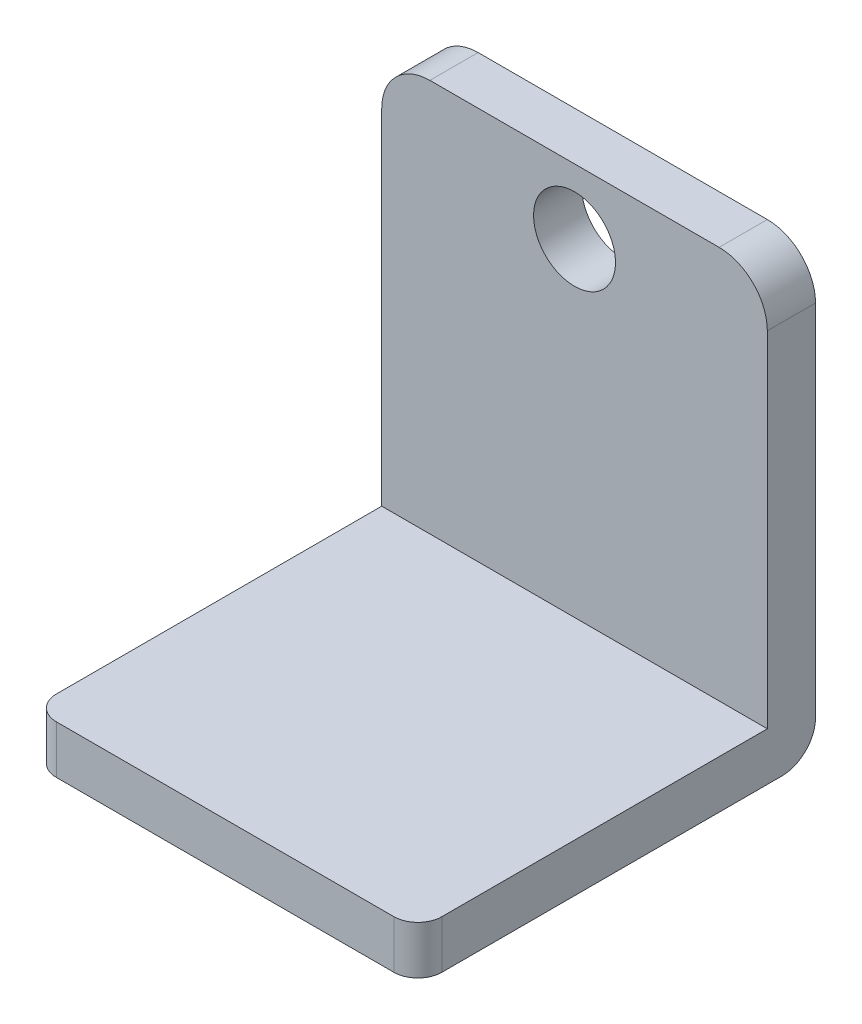
ISO-10303-21;
HEADER;
FILE_DESCRIPTION(('STEP AP214'),'2;1');
FILE_NAME('part.step','',(''),(''),'','','');
FILE_SCHEMA(('AUTOMOTIVE_DESIGN { 1 0 10303 214 1 1 1 1 }'));
ENDSEC;
DATA;
#1=APPLICATION_CONTEXT('core data for automotive mechanical design processes');
#2=APPLICATION_PROTOCOL_DEFINITION('international standard','automotive_design',2000,#1);
#3=PRODUCT_CONTEXT('',#1,'mechanical');
#4=PRODUCT('Part','Part','',(#3));
#5=PRODUCT_RELATED_PRODUCT_CATEGORY('part','',(#4));
#6=PRODUCT_DEFINITION_FORMATION('','',#4);
#7=PRODUCT_DEFINITION_CONTEXT('part definition',#1,'design');
#8=PRODUCT_DEFINITION('design','',#6,#7);
#9=PRODUCT_DEFINITION_SHAPE('','',#8);
#10=(LENGTH_UNIT() NAMED_UNIT(*) SI_UNIT(.MILLI.,.METRE.));
#11=(NAMED_UNIT(*) PLANE_ANGLE_UNIT() SI_UNIT($,.RADIAN.));
#12=(NAMED_UNIT(*) SI_UNIT($,.STERADIAN.) SOLID_ANGLE_UNIT());
#13=UNCERTAINTY_MEASURE_WITH_UNIT(LENGTH_MEASURE(1.E-05),#10,'distance_accuracy_value','');
#14=(GEOMETRIC_REPRESENTATION_CONTEXT(3) GLOBAL_UNCERTAINTY_ASSIGNED_CONTEXT((#13)) GLOBAL_UNIT_ASSIGNED_CONTEXT((#10,
#11,#12)) REPRESENTATION_CONTEXT('',''));
#15=CARTESIAN_POINT('',(0.,0.,0.));
#16=DIRECTION('',(0.,0.,1.));
#17=DIRECTION('',(1.,0.,0.));
#18=AXIS2_PLACEMENT_3D('',#15,#16,#17);
#19=CARTESIAN_POINT('',(-99.0809917355372,25.4,-108.317355371901));
#20=DIRECTION('',(1.,0.,0.));
#21=DIRECTION('',(0.,0.,-1.));
#22=AXIS2_PLACEMENT_3D('',#19,#20,#21);
#23=PLANE('',#22);
#24=DIRECTION('',(0.,0.,1.));
#25=VECTOR('',#24,1.);
#26=CARTESIAN_POINT('',(-99.0809917355372,0.,-108.317355371901));
#27=LINE('',#26,#25);
#28=CARTESIAN_POINT('',(-99.0809917355372,0.,-90.5373553719008));
#29=VERTEX_POINT('',#28);
#30=CARTESIAN_POINT('',(-99.0809917355372,0.,88.5326446280992));
#31=VERTEX_POINT('',#30);
#32=EDGE_CURVE('E154',#29,#31,#27,.T.);
#33=ORIENTED_EDGE('',*,*,#32,.T.);
#34=DIRECTION('',(0.,-1.,0.));
#35=VECTOR('',#34,1.);
#36=CARTESIAN_POINT('',(-99.0809917355372,25.4,88.5326446280992));
#37=LINE('',#36,#35);
#38=CARTESIAN_POINT('',(-99.0809917355372,25.4,88.5326446280992));
#39=VERTEX_POINT('',#38);
#40=EDGE_CURVE('E11',#31,#39,#37,.F.);
#41=ORIENTED_EDGE('',*,*,#40,.T.);
#42=DIRECTION('',(0.,0.,1.));
#43=VECTOR('',#42,1.);
#44=CARTESIAN_POINT('',(-99.0809917355372,25.4,-108.317355371901));
#45=LINE('',#44,#43);
#46=CARTESIAN_POINT('',(-99.0809917355372,25.4,-82.9173553719008));
#47=VERTEX_POINT('',#46);
#48=EDGE_CURVE('E155',#47,#39,#45,.T.);
#49=ORIENTED_EDGE('',*,*,#48,.F.);
#50=DIRECTION('',(0.,-1.,0.));
#51=VECTOR('',#50,1.);
#52=CARTESIAN_POINT('',(-99.0809917355372,232.41,-82.9173553719008));
#53=LINE('',#52,#51);
#54=CARTESIAN_POINT('',(-99.0809917355372,207.01,-82.9173553719008));
#55=VERTEX_POINT('',#54);
#56=EDGE_CURVE('E138',#55,#47,#53,.T.);
#57=ORIENTED_EDGE('',*,*,#56,.F.);
#58=DIRECTION('',(0.,0.,1.));
#59=VECTOR('',#58,1.);
#60=CARTESIAN_POINT('',(-99.0809917355372,207.01,-108.317355371901));
#61=LINE('',#60,#59);
#62=CARTESIAN_POINT('',(-99.0809917355372,207.01,-108.317355371901));
#63=VERTEX_POINT('',#62);
#64=EDGE_CURVE('E192',#55,#63,#61,.F.);
#65=ORIENTED_EDGE('',*,*,#64,.T.);
#66=DIRECTION('',(0.,-1.,0.));
#67=VECTOR('',#66,1.);
#68=CARTESIAN_POINT('',(-99.0809917355372,25.4,-108.317355371901));
#69=LINE('',#68,#67);
#70=CARTESIAN_POINT('',(-99.0809917355372,17.78,-108.317355371901));
#71=VERTEX_POINT('',#70);
#72=EDGE_CURVE('E127',#63,#71,#69,.T.);
#73=ORIENTED_EDGE('',*,*,#72,.T.);
#74=CARTESIAN_POINT('',(-99.0809917355372,17.78,-90.5373553719008));
#75=DIRECTION('',(1.,0.,0.));
#76=DIRECTION('',(0.,0.,-1.));
#77=AXIS2_PLACEMENT_3D('',#74,#75,#76);
#78=CIRCLE('',#77,17.78);
#79=EDGE_CURVE('E169',#71,#29,#78,.F.);
#80=ORIENTED_EDGE('',*,*,#79,.T.);
#81=EDGE_LOOP('',(#33,#41,#49,#57,#65,#73,#80));
#82=FACE_BOUND('',#81,.T.);
#83=ADVANCED_FACE('F33',(#82),#23,.F.);
#84=CARTESIAN_POINT('',(-99.0809917355372,25.4,101.232644628099));
#85=DIRECTION('',(0.,0.,-1.));
#86=DIRECTION('',(-1.,0.,0.));
#87=AXIS2_PLACEMENT_3D('',#84,#85,#86);
#88=PLANE('',#87);
#89=DIRECTION('',(1.,0.,0.));
#90=VECTOR('',#89,1.);
#91=CARTESIAN_POINT('',(-99.0809917355372,0.,101.232644628099));
#92=LINE('',#91,#90);
#93=CARTESIAN_POINT('',(-86.3809917355372,0.,101.232644628099));
#94=VERTEX_POINT('',#93);
#95=CARTESIAN_POINT('',(91.4190082644628,0.,101.232644628099));
#96=VERTEX_POINT('',#95);
#97=EDGE_CURVE('E160',#94,#96,#92,.T.);
#98=ORIENTED_EDGE('',*,*,#97,.T.);
#99=DIRECTION('',(0.,-1.,0.));
#100=VECTOR('',#99,1.);
#101=CARTESIAN_POINT('',(91.4190082644628,25.4,101.232644628099));
#102=LINE('',#101,#100);
#103=CARTESIAN_POINT('',(91.4190082644628,25.4,101.232644628099));
#104=VERTEX_POINT('',#103);
#105=EDGE_CURVE('E54',#96,#104,#102,.F.);
#106=ORIENTED_EDGE('',*,*,#105,.T.);
#107=DIRECTION('',(1.,0.,0.));
#108=VECTOR('',#107,1.);
#109=CARTESIAN_POINT('',(-99.0809917355372,25.4,101.232644628099));
#110=LINE('',#109,#108);
#111=CARTESIAN_POINT('',(-86.3809917355372,25.4,101.232644628099));
#112=VERTEX_POINT('',#111);
#113=EDGE_CURVE('E128',#112,#104,#110,.T.);
#114=ORIENTED_EDGE('',*,*,#113,.F.);
#115=DIRECTION('',(0.,-1.,0.));
#116=VECTOR('',#115,1.);
#117=CARTESIAN_POINT('',(-86.3809917355372,25.4,101.232644628099));
#118=LINE('',#117,#116);
#119=EDGE_CURVE('E200',#112,#94,#118,.T.);
#120=ORIENTED_EDGE('',*,*,#119,.T.);
#121=EDGE_LOOP('',(#98,#106,#114,#120));
#122=FACE_BOUND('',#121,.T.);
#123=ADVANCED_FACE('F208',(#122),#88,.F.);
#124=CARTESIAN_POINT('',(104.119008264463,25.4,-108.317355371901));
#125=DIRECTION('',(-1.,0.,0.));
#126=DIRECTION('',(0.,0.,1.));
#127=AXIS2_PLACEMENT_3D('',#124,#125,#126);
#128=PLANE('',#127);
#129=DIRECTION('',(0.,0.,-1.));
#130=VECTOR('',#129,1.);
#131=CARTESIAN_POINT('',(104.119008264463,25.4,-108.317355371901));
#132=LINE('',#131,#130);
#133=CARTESIAN_POINT('',(104.119008264463,25.4,88.5326446280992));
#134=VERTEX_POINT('',#133);
#135=CARTESIAN_POINT('',(104.119008264463,25.4,-82.9173553719008));
#136=VERTEX_POINT('',#135);
#137=EDGE_CURVE('E118',#134,#136,#132,.T.);
#138=ORIENTED_EDGE('',*,*,#137,.F.);
#139=DIRECTION('',(0.,-1.,0.));
#140=VECTOR('',#139,1.);
#141=CARTESIAN_POINT('',(104.119008264463,25.4,88.5326446280992));
#142=LINE('',#141,#140);
#143=CARTESIAN_POINT('',(104.119008264463,0.,88.5326446280992));
#144=VERTEX_POINT('',#143);
#145=EDGE_CURVE('E194',#134,#144,#142,.T.);
#146=ORIENTED_EDGE('',*,*,#145,.T.);
#147=DIRECTION('',(0.,0.,-1.));
#148=VECTOR('',#147,1.);
#149=CARTESIAN_POINT('',(104.119008264463,0.,-108.317355371901));
#150=LINE('',#149,#148);
#151=CARTESIAN_POINT('',(104.119008264463,0.,-90.5373553719008));
#152=VERTEX_POINT('',#151);
#153=EDGE_CURVE('E157',#144,#152,#150,.T.);
#154=ORIENTED_EDGE('',*,*,#153,.T.);
#155=CARTESIAN_POINT('',(104.119008264463,17.78,-90.5373553719008));
#156=DIRECTION('',(-1.,0.,0.));
#157=DIRECTION('',(0.,0.,1.));
#158=AXIS2_PLACEMENT_3D('',#155,#156,#157);
#159=CIRCLE('',#158,17.78);
#160=CARTESIAN_POINT('',(104.119008264463,17.78,-108.317355371901));
#161=VERTEX_POINT('',#160);
#162=EDGE_CURVE('E174',#152,#161,#159,.F.);
#163=ORIENTED_EDGE('',*,*,#162,.T.);
#164=DIRECTION('',(0.,-1.,0.));
#165=VECTOR('',#164,1.);
#166=CARTESIAN_POINT('',(104.119008264463,25.4,-108.317355371901));
#167=LINE('',#166,#165);
#168=CARTESIAN_POINT('',(104.119008264463,207.01,-108.317355371901));
#169=VERTEX_POINT('',#168);
#170=EDGE_CURVE('E164',#169,#161,#167,.T.);
#171=ORIENTED_EDGE('',*,*,#170,.F.);
#172=DIRECTION('',(0.,0.,-1.));
#173=VECTOR('',#172,1.);
#174=CARTESIAN_POINT('',(104.119008264463,207.01,-82.9173553719008));
#175=LINE('',#174,#173);
#176=CARTESIAN_POINT('',(104.119008264463,207.01,-82.9173553719008));
#177=VERTEX_POINT('',#176);
#178=EDGE_CURVE('E135',#169,#177,#175,.F.);
#179=ORIENTED_EDGE('',*,*,#178,.T.);
#180=DIRECTION('',(0.,-1.,0.));
#181=VECTOR('',#180,1.);
#182=CARTESIAN_POINT('',(104.119008264463,232.41,-82.9173553719008));
#183=LINE('',#182,#181);
#184=EDGE_CURVE('E131',#177,#136,#183,.T.);
#185=ORIENTED_EDGE('',*,*,#184,.T.);
#186=EDGE_LOOP('',(#138,#146,#154,#163,#171,#179,#185));
#187=FACE_BOUND('',#186,.T.);
#188=ADVANCED_FACE('F132',(#187),#128,.F.);
#189=CARTESIAN_POINT('',(-99.0809917355372,25.4,-108.317355371901));
#190=DIRECTION('',(0.,0.,1.));
#191=DIRECTION('',(1.,0.,0.));
#192=AXIS2_PLACEMENT_3D('',#189,#190,#191);
#193=PLANE('',#192);
#194=CARTESIAN_POINT('',(2.51900826446277,198.12,-108.317355371901));
#195=DIRECTION('',(0.,0.,-1.));
#196=DIRECTION('',(-1.,0.,0.));
#197=AXIS2_PLACEMENT_3D('',#194,#195,#196);
#198=CIRCLE('',#197,21.59);
#199=CARTESIAN_POINT('',(-19.0709917355372,198.12,-108.317355371901));
#200=VERTEX_POINT('',#199);
#201=EDGE_CURVE('E149',#200,#200,#198,.T.);
#202=ORIENTED_EDGE('',*,*,#201,.F.);
#203=EDGE_LOOP('',(#202));
#204=FACE_BOUND('',#203,.T.);
#205=DIRECTION('',(-1.,0.,0.));
#206=VECTOR('',#205,1.);
#207=CARTESIAN_POINT('',(-99.0809917355372,232.41,-108.317355371901));
#208=LINE('',#207,#206);
#209=CARTESIAN_POINT('',(78.7190082644628,232.41,-108.317355371901));
#210=VERTEX_POINT('',#209);
#211=CARTESIAN_POINT('',(-73.6809917355372,232.41,-108.317355371901));
#212=VERTEX_POINT('',#211);
#213=EDGE_CURVE('E139',#210,#212,#208,.T.);
#214=ORIENTED_EDGE('',*,*,#213,.F.);
#215=CARTESIAN_POINT('',(78.7190082644628,207.01,-108.317355371901));
#216=DIRECTION('',(0.,0.,1.));
#217=DIRECTION('',(1.,0.,0.));
#218=AXIS2_PLACEMENT_3D('',#215,#216,#217);
#219=CIRCLE('',#218,25.4);
#220=EDGE_CURVE('E185',#210,#169,#219,.F.);
#221=ORIENTED_EDGE('',*,*,#220,.T.);
#222=ORIENTED_EDGE('',*,*,#170,.T.);
#223=DIRECTION('',(-1.,0.,0.));
#224=VECTOR('',#223,1.);
#225=CARTESIAN_POINT('',(-99.0809917355372,17.78,-108.317355371901));
#226=LINE('',#225,#224);
#227=EDGE_CURVE('E166',#161,#71,#226,.T.);
#228=ORIENTED_EDGE('',*,*,#227,.T.);
#229=ORIENTED_EDGE('',*,*,#72,.F.);
#230=CARTESIAN_POINT('',(-73.6809917355372,207.01,-108.317355371901));
#231=DIRECTION('',(0.,0.,1.));
#232=DIRECTION('',(1.,0.,0.));
#233=AXIS2_PLACEMENT_3D('',#230,#231,#232);
#234=CIRCLE('',#233,25.4);
#235=EDGE_CURVE('E183',#63,#212,#234,.F.);
#236=ORIENTED_EDGE('',*,*,#235,.T.);
#237=EDGE_LOOP('',(#214,#221,#222,#228,#229,#236));
#238=FACE_BOUND('',#237,.T.);
#239=ADVANCED_FACE('F223',(#204,#238),#193,.F.);
#240=CARTESIAN_POINT('',(0.,25.4,0.));
#241=DIRECTION('',(0.,1.,0.));
#242=DIRECTION('',(0.,0.,1.));
#243=AXIS2_PLACEMENT_3D('',#240,#241,#242);
#244=PLANE('',#243);
#245=ORIENTED_EDGE('',*,*,#113,.T.);
#246=CARTESIAN_POINT('',(91.4190082644628,25.4,88.5326446280992));
#247=DIRECTION('',(0.,1.,0.));
#248=DIRECTION('',(0.,0.,1.));
#249=AXIS2_PLACEMENT_3D('',#246,#247,#248);
#250=CIRCLE('',#249,12.7);
#251=EDGE_CURVE('E41',#104,#134,#250,.T.);
#252=ORIENTED_EDGE('',*,*,#251,.T.);
#253=ORIENTED_EDGE('',*,*,#137,.T.);
#254=DIRECTION('',(1.,0.,0.));
#255=VECTOR('',#254,1.);
#256=CARTESIAN_POINT('',(-99.0809917355372,25.4,-82.9173553719008));
#257=LINE('',#256,#255);
#258=EDGE_CURVE('E122',#47,#136,#257,.T.);
#259=ORIENTED_EDGE('',*,*,#258,.F.);
#260=ORIENTED_EDGE('',*,*,#48,.T.);
#261=CARTESIAN_POINT('',(-86.3809917355372,25.4,88.5326446280992));
#262=DIRECTION('',(0.,1.,0.));
#263=DIRECTION('',(0.,0.,1.));
#264=AXIS2_PLACEMENT_3D('',#261,#262,#263);
#265=CIRCLE('',#264,12.7);
#266=EDGE_CURVE('E204',#39,#112,#265,.T.);
#267=ORIENTED_EDGE('',*,*,#266,.T.);
#268=EDGE_LOOP('',(#245,#252,#253,#259,#260,#267));
#269=FACE_BOUND('',#268,.T.);
#270=ADVANCED_FACE('F120',(#269),#244,.T.);
#271=CARTESIAN_POINT('',(0.,0.,0.));
#272=DIRECTION('',(0.,1.,0.));
#273=DIRECTION('',(0.,0.,1.));
#274=AXIS2_PLACEMENT_3D('',#271,#272,#273);
#275=PLANE('',#274);
#276=ORIENTED_EDGE('',*,*,#153,.F.);
#277=CARTESIAN_POINT('',(91.4190082644628,0.,88.5326446280992));
#278=DIRECTION('',(0.,1.,0.));
#279=DIRECTION('',(0.,0.,1.));
#280=AXIS2_PLACEMENT_3D('',#277,#278,#279);
#281=CIRCLE('',#280,12.7);
#282=EDGE_CURVE('E198',#144,#96,#281,.F.);
#283=ORIENTED_EDGE('',*,*,#282,.T.);
#284=ORIENTED_EDGE('',*,*,#97,.F.);
#285=CARTESIAN_POINT('',(-86.3809917355372,0.,88.5326446280992));
#286=DIRECTION('',(0.,1.,0.));
#287=DIRECTION('',(0.,0.,1.));
#288=AXIS2_PLACEMENT_3D('',#285,#286,#287);
#289=CIRCLE('',#288,12.7);
#290=EDGE_CURVE('E196',#94,#31,#289,.F.);
#291=ORIENTED_EDGE('',*,*,#290,.T.);
#292=ORIENTED_EDGE('',*,*,#32,.F.);
#293=DIRECTION('',(-1.,0.,0.));
#294=VECTOR('',#293,1.);
#295=CARTESIAN_POINT('',(0.,0.,-90.5373553719008));
#296=LINE('',#295,#294);
#297=EDGE_CURVE('E171',#29,#152,#296,.F.);
#298=ORIENTED_EDGE('',*,*,#297,.T.);
#299=EDGE_LOOP('',(#276,#283,#284,#291,#292,#298));
#300=FACE_BOUND('',#299,.T.);
#301=ADVANCED_FACE('F213',(#300),#275,.F.);
#302=CARTESIAN_POINT('',(-99.0809917355372,232.41,-82.9173553719008));
#303=DIRECTION('',(0.,0.,-1.));
#304=DIRECTION('',(-1.,0.,0.));
#305=AXIS2_PLACEMENT_3D('',#302,#303,#304);
#306=PLANE('',#305);
#307=CARTESIAN_POINT('',(2.51900826446277,198.12,-82.9173553719008));
#308=DIRECTION('',(0.,0.,-1.));
#309=DIRECTION('',(-1.,0.,0.));
#310=AXIS2_PLACEMENT_3D('',#307,#308,#309);
#311=CIRCLE('',#310,21.59);
#312=CARTESIAN_POINT('',(-19.0709917355372,198.12,-82.9173553719008));
#313=VERTEX_POINT('',#312);
#314=EDGE_CURVE('E144',#313,#313,#311,.F.);
#315=ORIENTED_EDGE('',*,*,#314,.F.);
#316=EDGE_LOOP('',(#315));
#317=FACE_BOUND('',#316,.T.);
#318=ORIENTED_EDGE('',*,*,#184,.F.);
#319=CARTESIAN_POINT('',(78.7190082644628,207.01,-82.9173553719008));
#320=DIRECTION('',(0.,0.,-1.));
#321=DIRECTION('',(-1.,0.,0.));
#322=AXIS2_PLACEMENT_3D('',#319,#320,#321);
#323=CIRCLE('',#322,25.4);
#324=CARTESIAN_POINT('',(78.7190082644628,232.41,-82.9173553719008));
#325=VERTEX_POINT('',#324);
#326=EDGE_CURVE('E190',#177,#325,#323,.F.);
#327=ORIENTED_EDGE('',*,*,#326,.T.);
#328=DIRECTION('',(1.,0.,0.));
#329=VECTOR('',#328,1.);
#330=CARTESIAN_POINT('',(-99.0809917355372,232.41,-82.9173553719008));
#331=LINE('',#330,#329);
#332=CARTESIAN_POINT('',(-73.6809917355372,232.41,-82.9173553719008));
#333=VERTEX_POINT('',#332);
#334=EDGE_CURVE('E143',#333,#325,#331,.T.);
#335=ORIENTED_EDGE('',*,*,#334,.F.);
#336=CARTESIAN_POINT('',(-73.6809917355372,207.01,-82.9173553719008));
#337=DIRECTION('',(0.,0.,-1.));
#338=DIRECTION('',(-1.,0.,0.));
#339=AXIS2_PLACEMENT_3D('',#336,#337,#338);
#340=CIRCLE('',#339,25.4);
#341=EDGE_CURVE('E188',#333,#55,#340,.F.);
#342=ORIENTED_EDGE('',*,*,#341,.T.);
#343=ORIENTED_EDGE('',*,*,#56,.T.);
#344=ORIENTED_EDGE('',*,*,#258,.T.);
#345=EDGE_LOOP('',(#318,#327,#335,#342,#343,#344));
#346=FACE_BOUND('',#345,.T.);
#347=ADVANCED_FACE('F141',(#317,#346),#306,.F.);
#348=CARTESIAN_POINT('',(0.,232.41,0.));
#349=DIRECTION('',(0.,1.,0.));
#350=DIRECTION('',(0.,0.,1.));
#351=AXIS2_PLACEMENT_3D('',#348,#349,#350);
#352=PLANE('',#351);
#353=ORIENTED_EDGE('',*,*,#334,.T.);
#354=DIRECTION('',(0.,0.,-1.));
#355=VECTOR('',#354,1.);
#356=CARTESIAN_POINT('',(78.7190082644628,232.41,-108.317355371901));
#357=LINE('',#356,#355);
#358=EDGE_CURVE('E180',#325,#210,#357,.T.);
#359=ORIENTED_EDGE('',*,*,#358,.T.);
#360=ORIENTED_EDGE('',*,*,#213,.T.);
#361=DIRECTION('',(0.,0.,1.));
#362=VECTOR('',#361,1.);
#363=CARTESIAN_POINT('',(-73.6809917355372,232.41,-82.9173553719008));
#364=LINE('',#363,#362);
#365=EDGE_CURVE('E177',#212,#333,#364,.T.);
#366=ORIENTED_EDGE('',*,*,#365,.T.);
#367=EDGE_LOOP('',(#353,#359,#360,#366));
#368=FACE_BOUND('',#367,.T.);
#369=ADVANCED_FACE('F254',(#368),#352,.T.);
#370=CARTESIAN_POINT('',(2.51900826446277,198.12,101.233644628099));
#371=DIRECTION('',(0.,0.,-1.));
#372=DIRECTION('',(-1.,0.,0.));
#373=AXIS2_PLACEMENT_3D('',#370,#371,#372);
#374=CYLINDRICAL_SURFACE('',#373,21.59);
#375=ORIENTED_EDGE('',*,*,#201,.T.);
#376=EDGE_LOOP('',(#375));
#377=FACE_BOUND('',#376,.T.);
#378=ORIENTED_EDGE('',*,*,#314,.T.);
#379=EDGE_LOOP('',(#378));
#380=FACE_BOUND('',#379,.T.);
#381=ADVANCED_FACE('F246',(#377,#380),#374,.F.);
#382=CARTESIAN_POINT('',(-99.0809917355372,17.78,-90.5373553719008));
#383=DIRECTION('',(-1.,0.,0.));
#384=DIRECTION('',(0.,0.,1.));
#385=AXIS2_PLACEMENT_3D('',#382,#383,#384);
#386=CYLINDRICAL_SURFACE('',#385,17.78);
#387=ORIENTED_EDGE('',*,*,#162,.F.);
#388=ORIENTED_EDGE('',*,*,#297,.F.);
#389=ORIENTED_EDGE('',*,*,#79,.F.);
#390=ORIENTED_EDGE('',*,*,#227,.F.);
#391=EDGE_LOOP('',(#387,#388,#389,#390));
#392=FACE_BOUND('',#391,.T.);
#393=ADVANCED_FACE('F220',(#392),#386,.T.);
#394=CARTESIAN_POINT('',(78.7190082644628,207.01,0.));
#395=DIRECTION('',(0.,0.,1.));
#396=DIRECTION('',(1.,0.,0.));
#397=AXIS2_PLACEMENT_3D('',#394,#395,#396);
#398=CYLINDRICAL_SURFACE('',#397,25.4);
#399=ORIENTED_EDGE('',*,*,#326,.F.);
#400=ORIENTED_EDGE('',*,*,#178,.F.);
#401=ORIENTED_EDGE('',*,*,#220,.F.);
#402=ORIENTED_EDGE('',*,*,#358,.F.);
#403=EDGE_LOOP('',(#399,#400,#401,#402));
#404=FACE_BOUND('',#403,.T.);
#405=ADVANCED_FACE('F233',(#404),#398,.T.);
#406=CARTESIAN_POINT('',(-73.6809917355372,207.01,0.));
#407=DIRECTION('',(0.,0.,-1.));
#408=DIRECTION('',(-1.,0.,0.));
#409=AXIS2_PLACEMENT_3D('',#406,#407,#408);
#410=CYLINDRICAL_SURFACE('',#409,25.4);
#411=ORIENTED_EDGE('',*,*,#235,.F.);
#412=ORIENTED_EDGE('',*,*,#64,.F.);
#413=ORIENTED_EDGE('',*,*,#341,.F.);
#414=ORIENTED_EDGE('',*,*,#365,.F.);
#415=EDGE_LOOP('',(#411,#412,#413,#414));
#416=FACE_BOUND('',#415,.T.);
#417=ADVANCED_FACE('F228',(#416),#410,.T.);
#418=CARTESIAN_POINT('',(91.4190082644628,25.4,88.5326446280992));
#419=DIRECTION('',(0.,-1.,0.));
#420=DIRECTION('',(0.,0.,-1.));
#421=AXIS2_PLACEMENT_3D('',#418,#419,#420);
#422=CYLINDRICAL_SURFACE('',#421,12.7);
#423=ORIENTED_EDGE('',*,*,#251,.F.);
#424=ORIENTED_EDGE('',*,*,#105,.F.);
#425=ORIENTED_EDGE('',*,*,#282,.F.);
#426=ORIENTED_EDGE('',*,*,#145,.F.);
#427=EDGE_LOOP('',(#423,#424,#425,#426));
#428=FACE_BOUND('',#427,.T.);
#429=ADVANCED_FACE('F226',(#428),#422,.T.);
#430=CARTESIAN_POINT('',(-86.3809917355372,25.4,88.5326446280992));
#431=DIRECTION('',(0.,-1.,0.));
#432=DIRECTION('',(0.,0.,-1.));
#433=AXIS2_PLACEMENT_3D('',#430,#431,#432);
#434=CYLINDRICAL_SURFACE('',#433,12.7);
#435=ORIENTED_EDGE('',*,*,#266,.F.);
#436=ORIENTED_EDGE('',*,*,#40,.F.);
#437=ORIENTED_EDGE('',*,*,#290,.F.);
#438=ORIENTED_EDGE('',*,*,#119,.F.);
#439=EDGE_LOOP('',(#435,#436,#437,#438));
#440=FACE_BOUND('',#439,.T.);
#441=ADVANCED_FACE('F35',(#440),#434,.T.);
#442=CLOSED_SHELL('',(#83,#123,#188,#239,#270,#301,#347,#369,#381,#393,#405,#417,#429,#441));
#443=MANIFOLD_SOLID_BREP('B2',#442);
#444=ADVANCED_BREP_SHAPE_REPRESENTATION('',(#18,#443),#14);
#445=SHAPE_DEFINITION_REPRESENTATION(#9,#444);
ENDSEC;
END-ISO-10303-21;
